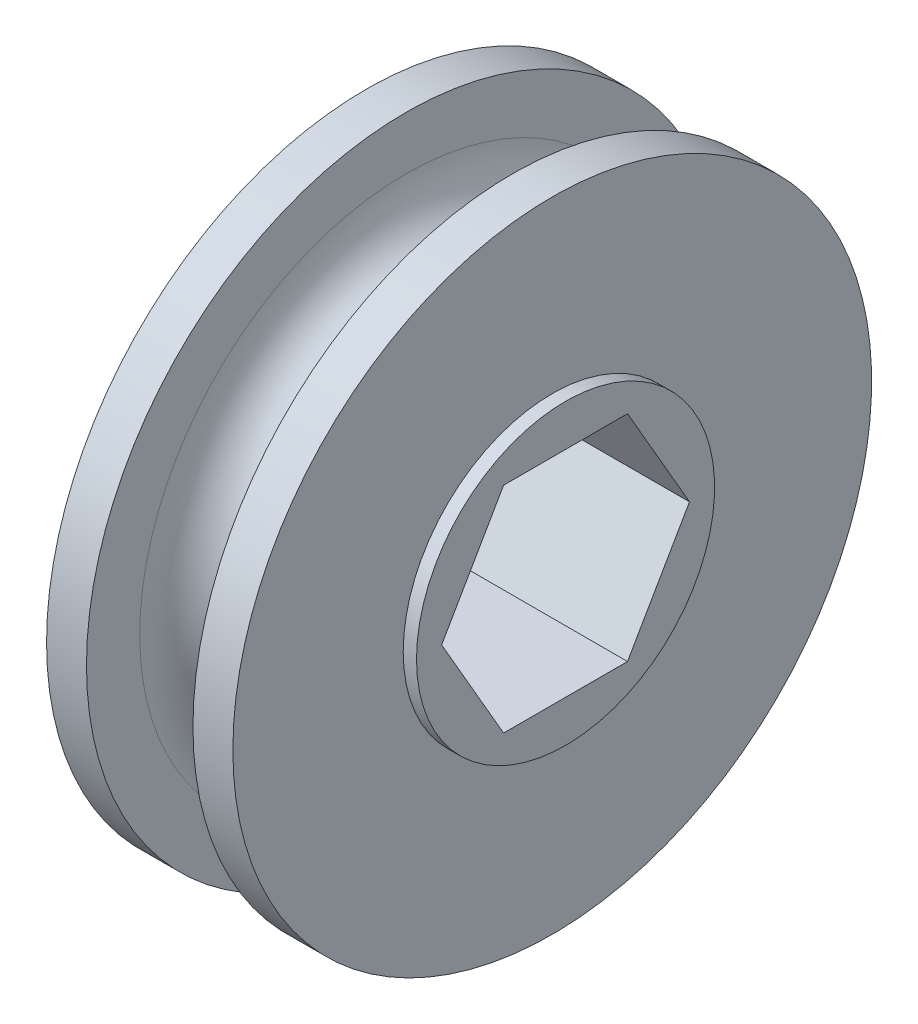
ISO-10303-21;
HEADER;
FILE_DESCRIPTION(('STEP AP214'),'2;1');
FILE_NAME('part.step','',(''),(''),'','','');
FILE_SCHEMA(('AUTOMOTIVE_DESIGN { 1 0 10303 214 1 1 1 1 }'));
ENDSEC;
DATA;
#1=APPLICATION_CONTEXT('core data for automotive mechanical design processes');
#2=APPLICATION_PROTOCOL_DEFINITION('international standard','automotive_design',2000,#1);
#3=PRODUCT_CONTEXT('',#1,'mechanical');
#4=PRODUCT('Part','Part','',(#3));
#5=PRODUCT_RELATED_PRODUCT_CATEGORY('part','',(#4));
#6=PRODUCT_DEFINITION_FORMATION('','',#4);
#7=PRODUCT_DEFINITION_CONTEXT('part definition',#1,'design');
#8=PRODUCT_DEFINITION('design','',#6,#7);
#9=PRODUCT_DEFINITION_SHAPE('','',#8);
#10=(LENGTH_UNIT() NAMED_UNIT(*) SI_UNIT(.MILLI.,.METRE.));
#11=(NAMED_UNIT(*) PLANE_ANGLE_UNIT() SI_UNIT($,.RADIAN.));
#12=(NAMED_UNIT(*) SI_UNIT($,.STERADIAN.) SOLID_ANGLE_UNIT());
#13=UNCERTAINTY_MEASURE_WITH_UNIT(LENGTH_MEASURE(1.E-05),#10,'distance_accuracy_value','');
#14=(GEOMETRIC_REPRESENTATION_CONTEXT(3) GLOBAL_UNCERTAINTY_ASSIGNED_CONTEXT((#13)) GLOBAL_UNIT_ASSIGNED_CONTEXT((#10,
#11,#12)) REPRESENTATION_CONTEXT('',''));
#15=CARTESIAN_POINT('',(0.,0.,0.));
#16=DIRECTION('',(0.,0.,1.));
#17=DIRECTION('',(1.,0.,0.));
#18=AXIS2_PLACEMENT_3D('',#15,#16,#17);
#19=CARTESIAN_POINT('',(-6.35,0.,0.));
#20=DIRECTION('',(-1.,0.,0.));
#21=DIRECTION('',(0.,0.,1.));
#22=AXIS2_PLACEMENT_3D('',#19,#20,#21);
#23=CYLINDRICAL_SURFACE('',#22,19.05);
#24=CARTESIAN_POINT('',(-5.55625,0.,0.));
#25=DIRECTION('',(-1.,0.,0.));
#26=DIRECTION('',(0.,0.,1.));
#27=AXIS2_PLACEMENT_3D('',#24,#25,#26);
#28=CIRCLE('',#27,19.05);
#29=CARTESIAN_POINT('',(-5.55625,0.,19.05));
#30=VERTEX_POINT('',#29);
#31=EDGE_CURVE('E230',#30,#30,#28,.F.);
#32=ORIENTED_EDGE('',*,*,#31,.T.);
#33=EDGE_LOOP('',(#32));
#34=FACE_BOUND('',#33,.T.);
#35=CARTESIAN_POINT('',(-3.175,0.,0.));
#36=DIRECTION('',(-1.,0.,0.));
#37=DIRECTION('',(0.,0.,1.));
#38=AXIS2_PLACEMENT_3D('',#35,#36,#37);
#39=CIRCLE('',#38,19.05);
#40=CARTESIAN_POINT('',(-3.175,0.,19.05));
#41=VERTEX_POINT('',#40);
#42=EDGE_CURVE('E233',#41,#41,#39,.T.);
#43=ORIENTED_EDGE('',*,*,#42,.T.);
#44=EDGE_LOOP('',(#43));
#45=FACE_BOUND('',#44,.T.);
#46=ADVANCED_FACE('F16',(#34,#45),#23,.T.);
#47=CARTESIAN_POINT('',(-5.55625,0.,-8.89));
#48=DIRECTION('',(1.,0.,0.));
#49=DIRECTION('',(0.,0.,-1.));
#50=AXIS2_PLACEMENT_3D('',#47,#48,#49);
#51=PLANE('',#50);
#52=ORIENTED_EDGE('',*,*,#31,.F.);
#53=EDGE_LOOP('',(#52));
#54=FACE_BOUND('',#53,.T.);
#55=CARTESIAN_POINT('',(-5.55625,0.,0.));
#56=DIRECTION('',(-1.,0.,0.));
#57=DIRECTION('',(0.,0.,1.));
#58=AXIS2_PLACEMENT_3D('',#55,#56,#57);
#59=CIRCLE('',#58,8.89);
#60=CARTESIAN_POINT('',(-5.55625,0.,8.89));
#61=VERTEX_POINT('',#60);
#62=EDGE_CURVE('E89',#61,#61,#59,.T.);
#63=ORIENTED_EDGE('',*,*,#62,.F.);
#64=EDGE_LOOP('',(#63));
#65=FACE_BOUND('',#64,.T.);
#66=ADVANCED_FACE('F111',(#54,#65),#51,.F.);
#67=CARTESIAN_POINT('',(-3.175,0.,-19.05));
#68=DIRECTION('',(-1.,0.,0.));
#69=DIRECTION('',(0.,0.,1.));
#70=AXIS2_PLACEMENT_3D('',#67,#68,#69);
#71=PLANE('',#70);
#72=ORIENTED_EDGE('',*,*,#42,.F.);
#73=EDGE_LOOP('',(#72));
#74=FACE_BOUND('',#73,.T.);
#75=CARTESIAN_POINT('',(-3.175,0.,0.));
#76=DIRECTION('',(1.,0.,0.));
#77=DIRECTION('',(0.,0.,1.));
#78=AXIS2_PLACEMENT_3D('',#75,#76,#77);
#79=CIRCLE('',#78,15.875);
#80=CARTESIAN_POINT('',(-3.175,0.,-15.875));
#81=VERTEX_POINT('',#80);
#82=CARTESIAN_POINT('',(-3.175,0.,15.875));
#83=VERTEX_POINT('',#82);
#84=EDGE_CURVE('E81',#81,#83,#79,.F.);
#85=ORIENTED_EDGE('',*,*,#84,.T.);
#86=CARTESIAN_POINT('',(-3.175,0.,0.));
#87=DIRECTION('',(1.,0.,0.));
#88=DIRECTION('',(0.,0.,-1.));
#89=AXIS2_PLACEMENT_3D('',#86,#87,#88);
#90=CIRCLE('',#89,15.875);
#91=EDGE_CURVE('E87',#83,#81,#90,.F.);
#92=ORIENTED_EDGE('',*,*,#91,.T.);
#93=EDGE_LOOP('',(#85,#92));
#94=FACE_BOUND('',#93,.T.);
#95=ADVANCED_FACE('F92',(#74,#94),#71,.F.);
#96=CARTESIAN_POINT('',(-6.35,0.,0.));
#97=DIRECTION('',(-1.,0.,0.));
#98=DIRECTION('',(0.,0.,1.));
#99=AXIS2_PLACEMENT_3D('',#96,#97,#98);
#100=CYLINDRICAL_SURFACE('',#99,8.89);
#101=CARTESIAN_POINT('',(-6.35,0.,0.));
#102=DIRECTION('',(-1.,0.,0.));
#103=DIRECTION('',(0.,0.,1.));
#104=AXIS2_PLACEMENT_3D('',#101,#102,#103);
#105=CIRCLE('',#104,8.89);
#106=CARTESIAN_POINT('',(-6.35,0.,8.89));
#107=VERTEX_POINT('',#106);
#108=EDGE_CURVE('E93',#107,#107,#105,.F.);
#109=ORIENTED_EDGE('',*,*,#108,.T.);
#110=EDGE_LOOP('',(#109));
#111=FACE_BOUND('',#110,.T.);
#112=ORIENTED_EDGE('',*,*,#62,.T.);
#113=EDGE_LOOP('',(#112));
#114=FACE_BOUND('',#113,.T.);
#115=ADVANCED_FACE('F110',(#111,#114),#100,.T.);
#116=CARTESIAN_POINT('',(-6.35,0.,-6.4008));
#117=DIRECTION('',(1.,0.,0.));
#118=DIRECTION('',(0.,0.,-1.));
#119=AXIS2_PLACEMENT_3D('',#116,#117,#118);
#120=PLANE('',#119);
#121=ORIENTED_EDGE('',*,*,#108,.F.);
#122=EDGE_LOOP('',(#121));
#123=FACE_BOUND('',#122,.T.);
#124=DIRECTION('',(0.,-0.866025403784439,-0.5));
#125=VECTOR('',#124,1.);
#126=CARTESIAN_POINT('',(-6.35,-6.40079999999999,3.69550360302895));
#127=LINE('',#126,#125);
#128=CARTESIAN_POINT('',(-6.35,0.,7.3910072060579));
#129=VERTEX_POINT('',#128);
#130=CARTESIAN_POINT('',(-6.35,-6.40079999999999,3.69550360302895));
#131=VERTEX_POINT('',#130);
#132=EDGE_CURVE('E185',#129,#131,#127,.T.);
#133=ORIENTED_EDGE('',*,*,#132,.T.);
#134=DIRECTION('',(0.,0.,-1.));
#135=VECTOR('',#134,1.);
#136=CARTESIAN_POINT('',(-6.35,-6.40079999999999,-3.69550360302896));
#137=LINE('',#136,#135);
#138=CARTESIAN_POINT('',(-6.35,-6.40079999999999,-3.69550360302896));
#139=VERTEX_POINT('',#138);
#140=EDGE_CURVE('E180',#131,#139,#137,.T.);
#141=ORIENTED_EDGE('',*,*,#140,.T.);
#142=DIRECTION('',(0.,0.866025403784439,-0.5));
#143=VECTOR('',#142,1.);
#144=CARTESIAN_POINT('',(-6.35,0.,-7.39100720605791));
#145=LINE('',#144,#143);
#146=CARTESIAN_POINT('',(-6.35,0.,-7.39100720605791));
#147=VERTEX_POINT('',#146);
#148=EDGE_CURVE('E175',#139,#147,#145,.T.);
#149=ORIENTED_EDGE('',*,*,#148,.T.);
#150=DIRECTION('',(0.,0.866025403784439,0.5));
#151=VECTOR('',#150,1.);
#152=CARTESIAN_POINT('',(-6.35,6.4008,-3.69550360302895));
#153=LINE('',#152,#151);
#154=CARTESIAN_POINT('',(-6.35,6.4008,-3.69550360302896));
#155=VERTEX_POINT('',#154);
#156=EDGE_CURVE('E162',#147,#155,#153,.T.);
#157=ORIENTED_EDGE('',*,*,#156,.T.);
#158=DIRECTION('',(0.,0.,1.));
#159=VECTOR('',#158,1.);
#160=CARTESIAN_POINT('',(-6.35,6.4008,3.69550360302895));
#161=LINE('',#160,#159);
#162=CARTESIAN_POINT('',(-6.35,6.4008,3.69550360302895));
#163=VERTEX_POINT('',#162);
#164=EDGE_CURVE('E195',#155,#163,#161,.T.);
#165=ORIENTED_EDGE('',*,*,#164,.T.);
#166=DIRECTION('',(0.,-0.866025403784439,0.5));
#167=VECTOR('',#166,1.);
#168=CARTESIAN_POINT('',(-6.35,0.,7.3910072060579));
#169=LINE('',#168,#167);
#170=EDGE_CURVE('E190',#163,#129,#169,.T.);
#171=ORIENTED_EDGE('',*,*,#170,.T.);
#172=EDGE_LOOP('',(#133,#141,#149,#157,#165,#171));
#173=FACE_BOUND('',#172,.T.);
#174=ADVANCED_FACE('F205',(#123,#173),#120,.F.);
#175=CARTESIAN_POINT('',(0.,0.,0.));
#176=DIRECTION('',(1.,0.,0.));
#177=DIRECTION('',(0.,0.,-1.));
#178=AXIS2_PLACEMENT_3D('',#175,#176,#177);
#179=TOROIDAL_SURFACE('',#178,15.875,3.175);
#180=ORIENTED_EDGE('',*,*,#91,.F.);
#181=ORIENTED_EDGE('',*,*,#84,.F.);
#182=EDGE_LOOP('',(#180,#181));
#183=FACE_BOUND('',#182,.T.);
#184=CARTESIAN_POINT('',(3.175,0.,0.));
#185=DIRECTION('',(-1.,0.,0.));
#186=DIRECTION('',(0.,0.,1.));
#187=AXIS2_PLACEMENT_3D('',#184,#185,#186);
#188=CIRCLE('',#187,15.875);
#189=CARTESIAN_POINT('',(3.175,0.,15.875));
#190=VERTEX_POINT('',#189);
#191=CARTESIAN_POINT('',(3.175,0.,-15.875));
#192=VERTEX_POINT('',#191);
#193=EDGE_CURVE('E270',#190,#192,#188,.T.);
#194=ORIENTED_EDGE('',*,*,#193,.T.);
#195=CARTESIAN_POINT('',(3.175,0.,0.));
#196=DIRECTION('',(-1.,0.,0.));
#197=DIRECTION('',(0.,0.,-1.));
#198=AXIS2_PLACEMENT_3D('',#195,#196,#197);
#199=CIRCLE('',#198,15.875);
#200=EDGE_CURVE('E170',#192,#190,#199,.T.);
#201=ORIENTED_EDGE('',*,*,#200,.T.);
#202=EDGE_LOOP('',(#194,#201));
#203=FACE_BOUND('',#202,.T.);
#204=ADVANCED_FACE('F85',(#183,#203),#179,.F.);
#205=CARTESIAN_POINT('',(6.35000000000001,6.4008,3.69550360302895));
#206=DIRECTION('',(0.,1.,0.));
#207=DIRECTION('',(0.,0.,1.));
#208=AXIS2_PLACEMENT_3D('',#205,#206,#207);
#209=PLANE('',#208);
#210=DIRECTION('',(1.,0.,0.));
#211=VECTOR('',#210,1.);
#212=CARTESIAN_POINT('',(6.35,6.4008,-3.69550360302896));
#213=LINE('',#212,#211);
#214=CARTESIAN_POINT('',(6.35,6.4008,-3.69550360302896));
#215=VERTEX_POINT('',#214);
#216=EDGE_CURVE('E172',#155,#215,#213,.T.);
#217=ORIENTED_EDGE('',*,*,#216,.T.);
#218=DIRECTION('',(0.,0.,1.));
#219=VECTOR('',#218,1.);
#220=CARTESIAN_POINT('',(6.35,6.4008,-8.89));
#221=LINE('',#220,#219);
#222=CARTESIAN_POINT('',(6.35,6.4008,3.69550360302895));
#223=VERTEX_POINT('',#222);
#224=EDGE_CURVE('E268',#215,#223,#221,.T.);
#225=ORIENTED_EDGE('',*,*,#224,.T.);
#226=DIRECTION('',(1.,0.,0.));
#227=VECTOR('',#226,1.);
#228=CARTESIAN_POINT('',(6.35000000000001,6.4008,3.69550360302895));
#229=LINE('',#228,#227);
#230=EDGE_CURVE('E192',#223,#163,#229,.F.);
#231=ORIENTED_EDGE('',*,*,#230,.T.);
#232=ORIENTED_EDGE('',*,*,#164,.F.);
#233=EDGE_LOOP('',(#217,#225,#231,#232));
#234=FACE_BOUND('',#233,.T.);
#235=ADVANCED_FACE('F204',(#234),#209,.F.);
#236=CARTESIAN_POINT('',(6.35000000000001,0.,7.3910072060579));
#237=DIRECTION('',(0.,0.5,0.866025403784439));
#238=DIRECTION('',(0.,-0.866025403784439,0.5));
#239=AXIS2_PLACEMENT_3D('',#236,#237,#238);
#240=PLANE('',#239);
#241=ORIENTED_EDGE('',*,*,#230,.F.);
#242=DIRECTION('',(0.,-0.866025403784439,0.5));
#243=VECTOR('',#242,1.);
#244=CARTESIAN_POINT('',(6.35,6.4008,3.69550360302895));
#245=LINE('',#244,#243);
#246=CARTESIAN_POINT('',(6.35,0.,7.3910072060579));
#247=VERTEX_POINT('',#246);
#248=EDGE_CURVE('E265',#223,#247,#245,.T.);
#249=ORIENTED_EDGE('',*,*,#248,.T.);
#250=DIRECTION('',(1.,0.,0.));
#251=VECTOR('',#250,1.);
#252=CARTESIAN_POINT('',(6.35000000000001,0.,7.3910072060579));
#253=LINE('',#252,#251);
#254=EDGE_CURVE('E187',#247,#129,#253,.F.);
#255=ORIENTED_EDGE('',*,*,#254,.T.);
#256=ORIENTED_EDGE('',*,*,#170,.F.);
#257=EDGE_LOOP('',(#241,#249,#255,#256));
#258=FACE_BOUND('',#257,.T.);
#259=ADVANCED_FACE('F278',(#258),#240,.F.);
#260=CARTESIAN_POINT('',(6.35000000000001,-6.40079999999999,3.69550360302895));
#261=DIRECTION('',(0.,-0.5,0.866025403784439));
#262=DIRECTION('',(0.,-0.866025403784439,-0.5));
#263=AXIS2_PLACEMENT_3D('',#260,#261,#262);
#264=PLANE('',#263);
#265=ORIENTED_EDGE('',*,*,#254,.F.);
#266=DIRECTION('',(0.,-0.866025403784439,-0.499999999999999));
#267=VECTOR('',#266,1.);
#268=CARTESIAN_POINT('',(6.35,0.,7.3910072060579));
#269=LINE('',#268,#267);
#270=CARTESIAN_POINT('',(6.35,-6.40079999999999,3.69550360302895));
#271=VERTEX_POINT('',#270);
#272=EDGE_CURVE('E262',#247,#271,#269,.T.);
#273=ORIENTED_EDGE('',*,*,#272,.T.);
#274=DIRECTION('',(1.,0.,0.));
#275=VECTOR('',#274,1.);
#276=CARTESIAN_POINT('',(6.35,-6.40079999999999,3.69550360302895));
#277=LINE('',#276,#275);
#278=EDGE_CURVE('E182',#271,#131,#277,.F.);
#279=ORIENTED_EDGE('',*,*,#278,.T.);
#280=ORIENTED_EDGE('',*,*,#132,.F.);
#281=EDGE_LOOP('',(#265,#273,#279,#280));
#282=FACE_BOUND('',#281,.T.);
#283=ADVANCED_FACE('F284',(#282),#264,.F.);
#284=CARTESIAN_POINT('',(6.35,-6.40079999999999,-3.69550360302896));
#285=DIRECTION('',(0.,-1.,0.));
#286=DIRECTION('',(0.,0.,-1.));
#287=AXIS2_PLACEMENT_3D('',#284,#285,#286);
#288=PLANE('',#287);
#289=ORIENTED_EDGE('',*,*,#278,.F.);
#290=DIRECTION('',(0.,0.,1.));
#291=VECTOR('',#290,1.);
#292=CARTESIAN_POINT('',(6.35,-6.40079999999999,-8.89));
#293=LINE('',#292,#291);
#294=CARTESIAN_POINT('',(6.35,-6.40079999999999,-3.69550360302896));
#295=VERTEX_POINT('',#294);
#296=EDGE_CURVE('E257',#271,#295,#293,.F.);
#297=ORIENTED_EDGE('',*,*,#296,.T.);
#298=DIRECTION('',(1.,0.,0.));
#299=VECTOR('',#298,1.);
#300=CARTESIAN_POINT('',(6.35,-6.40079999999999,-3.69550360302896));
#301=LINE('',#300,#299);
#302=EDGE_CURVE('E177',#295,#139,#301,.F.);
#303=ORIENTED_EDGE('',*,*,#302,.T.);
#304=ORIENTED_EDGE('',*,*,#140,.F.);
#305=EDGE_LOOP('',(#289,#297,#303,#304));
#306=FACE_BOUND('',#305,.T.);
#307=ADVANCED_FACE('F286',(#306),#288,.F.);
#308=CARTESIAN_POINT('',(6.35,0.,-7.39100720605791));
#309=DIRECTION('',(0.,-0.5,-0.866025403784439));
#310=DIRECTION('',(0.,0.866025403784439,-0.5));
#311=AXIS2_PLACEMENT_3D('',#308,#309,#310);
#312=PLANE('',#311);
#313=ORIENTED_EDGE('',*,*,#302,.F.);
#314=DIRECTION('',(0.,0.866025403784438,-0.5));
#315=VECTOR('',#314,1.);
#316=CARTESIAN_POINT('',(6.35,-6.40079999999999,-3.69550360302896));
#317=LINE('',#316,#315);
#318=CARTESIAN_POINT('',(6.35,0.,-7.39100720605791));
#319=VERTEX_POINT('',#318);
#320=EDGE_CURVE('E253',#295,#319,#317,.T.);
#321=ORIENTED_EDGE('',*,*,#320,.T.);
#322=DIRECTION('',(1.,0.,0.));
#323=VECTOR('',#322,1.);
#324=CARTESIAN_POINT('',(6.35,0.,-7.39100720605791));
#325=LINE('',#324,#323);
#326=EDGE_CURVE('E36',#319,#147,#325,.F.);
#327=ORIENTED_EDGE('',*,*,#326,.T.);
#328=ORIENTED_EDGE('',*,*,#148,.F.);
#329=EDGE_LOOP('',(#313,#321,#327,#328));
#330=FACE_BOUND('',#329,.T.);
#331=ADVANCED_FACE('F288',(#330),#312,.F.);
#332=CARTESIAN_POINT('',(6.35,6.4008,-3.69550360302896));
#333=DIRECTION('',(0.,0.5,-0.866025403784439));
#334=DIRECTION('',(0.,0.866025403784439,0.5));
#335=AXIS2_PLACEMENT_3D('',#332,#333,#334);
#336=PLANE('',#335);
#337=ORIENTED_EDGE('',*,*,#326,.F.);
#338=DIRECTION('',(0.,0.866025403784439,0.5));
#339=VECTOR('',#338,1.);
#340=CARTESIAN_POINT('',(6.35,0.,-7.39100720605791));
#341=LINE('',#340,#339);
#342=EDGE_CURVE('E244',#319,#215,#341,.T.);
#343=ORIENTED_EDGE('',*,*,#342,.T.);
#344=ORIENTED_EDGE('',*,*,#216,.F.);
#345=ORIENTED_EDGE('',*,*,#156,.F.);
#346=EDGE_LOOP('',(#337,#343,#344,#345));
#347=FACE_BOUND('',#346,.T.);
#348=ADVANCED_FACE('F149',(#347),#336,.F.);
#349=CARTESIAN_POINT('',(3.175,0.,-12.7));
#350=DIRECTION('',(1.,0.,0.));
#351=DIRECTION('',(0.,0.,-1.));
#352=AXIS2_PLACEMENT_3D('',#349,#350,#351);
#353=PLANE('',#352);
#354=CARTESIAN_POINT('',(3.175,0.,0.));
#355=DIRECTION('',(-1.,0.,0.));
#356=DIRECTION('',(0.,0.,1.));
#357=AXIS2_PLACEMENT_3D('',#354,#355,#356);
#358=CIRCLE('',#357,19.05);
#359=CARTESIAN_POINT('',(3.175,0.,19.05));
#360=VERTEX_POINT('',#359);
#361=EDGE_CURVE('E240',#360,#360,#358,.F.);
#362=ORIENTED_EDGE('',*,*,#361,.F.);
#363=EDGE_LOOP('',(#362));
#364=FACE_BOUND('',#363,.T.);
#365=ORIENTED_EDGE('',*,*,#200,.F.);
#366=ORIENTED_EDGE('',*,*,#193,.F.);
#367=EDGE_LOOP('',(#365,#366));
#368=FACE_BOUND('',#367,.T.);
#369=ADVANCED_FACE('F144',(#364,#368),#353,.F.);
#370=CARTESIAN_POINT('',(6.35,0.,-8.89));
#371=DIRECTION('',(-1.,0.,0.));
#372=DIRECTION('',(0.,0.,1.));
#373=AXIS2_PLACEMENT_3D('',#370,#371,#372);
#374=PLANE('',#373);
#375=ORIENTED_EDGE('',*,*,#320,.F.);
#376=ORIENTED_EDGE('',*,*,#296,.F.);
#377=ORIENTED_EDGE('',*,*,#272,.F.);
#378=ORIENTED_EDGE('',*,*,#248,.F.);
#379=ORIENTED_EDGE('',*,*,#224,.F.);
#380=ORIENTED_EDGE('',*,*,#342,.F.);
#381=EDGE_LOOP('',(#375,#376,#377,#378,#379,#380));
#382=FACE_BOUND('',#381,.T.);
#383=CARTESIAN_POINT('',(6.35,0.,0.));
#384=DIRECTION('',(-1.,0.,0.));
#385=DIRECTION('',(0.,0.,1.));
#386=AXIS2_PLACEMENT_3D('',#383,#384,#385);
#387=CIRCLE('',#386,8.89);
#388=CARTESIAN_POINT('',(6.35,0.,8.89));
#389=VERTEX_POINT('',#388);
#390=EDGE_CURVE('E243',#389,#389,#387,.T.);
#391=ORIENTED_EDGE('',*,*,#390,.F.);
#392=EDGE_LOOP('',(#391));
#393=FACE_BOUND('',#392,.T.);
#394=ADVANCED_FACE('F140',(#382,#393),#374,.F.);
#395=CARTESIAN_POINT('',(-6.35,0.,0.));
#396=DIRECTION('',(-1.,0.,0.));
#397=DIRECTION('',(0.,0.,1.));
#398=AXIS2_PLACEMENT_3D('',#395,#396,#397);
#399=CYLINDRICAL_SURFACE('',#398,19.05);
#400=ORIENTED_EDGE('',*,*,#361,.T.);
#401=EDGE_LOOP('',(#400));
#402=FACE_BOUND('',#401,.T.);
#403=CARTESIAN_POINT('',(5.55625,0.,0.));
#404=DIRECTION('',(-1.,0.,0.));
#405=DIRECTION('',(0.,0.,1.));
#406=AXIS2_PLACEMENT_3D('',#403,#404,#405);
#407=CIRCLE('',#406,19.05);
#408=CARTESIAN_POINT('',(5.55625,0.,19.05));
#409=VERTEX_POINT('',#408);
#410=EDGE_CURVE('E27',#409,#409,#407,.T.);
#411=ORIENTED_EDGE('',*,*,#410,.T.);
#412=EDGE_LOOP('',(#411));
#413=FACE_BOUND('',#412,.T.);
#414=ADVANCED_FACE('F132',(#402,#413),#399,.T.);
#415=CARTESIAN_POINT('',(-6.35,0.,0.));
#416=DIRECTION('',(-1.,0.,0.));
#417=DIRECTION('',(0.,0.,1.));
#418=AXIS2_PLACEMENT_3D('',#415,#416,#417);
#419=CYLINDRICAL_SURFACE('',#418,8.89);
#420=CARTESIAN_POINT('',(5.55625,0.,0.));
#421=DIRECTION('',(-1.,0.,0.));
#422=DIRECTION('',(0.,0.,1.));
#423=AXIS2_PLACEMENT_3D('',#420,#421,#422);
#424=CIRCLE('',#423,8.89);
#425=CARTESIAN_POINT('',(5.55625,0.,8.89));
#426=VERTEX_POINT('',#425);
#427=EDGE_CURVE('E9',#426,#426,#424,.F.);
#428=ORIENTED_EDGE('',*,*,#427,.T.);
#429=EDGE_LOOP('',(#428));
#430=FACE_BOUND('',#429,.T.);
#431=ORIENTED_EDGE('',*,*,#390,.T.);
#432=EDGE_LOOP('',(#431));
#433=FACE_BOUND('',#432,.T.);
#434=ADVANCED_FACE('F126',(#430,#433),#419,.T.);
#435=CARTESIAN_POINT('',(5.55625,0.,-19.05));
#436=DIRECTION('',(-1.,0.,0.));
#437=DIRECTION('',(0.,0.,1.));
#438=AXIS2_PLACEMENT_3D('',#435,#436,#437);
#439=PLANE('',#438);
#440=ORIENTED_EDGE('',*,*,#427,.F.);
#441=EDGE_LOOP('',(#440));
#442=FACE_BOUND('',#441,.T.);
#443=ORIENTED_EDGE('',*,*,#410,.F.);
#444=EDGE_LOOP('',(#443));
#445=FACE_BOUND('',#444,.T.);
#446=ADVANCED_FACE('F124',(#442,#445),#439,.F.);
#447=CLOSED_SHELL('',(#46,#66,#95,#115,#174,#204,#235,#259,#283,#307,#331,#348,#369,#394,#414,
#434,#446));
#448=MANIFOLD_SOLID_BREP('B1',#447);
#449=ADVANCED_BREP_SHAPE_REPRESENTATION('',(#18,#448),#14);
#450=SHAPE_DEFINITION_REPRESENTATION(#9,#449);
ENDSEC;
END-ISO-10303-21;
